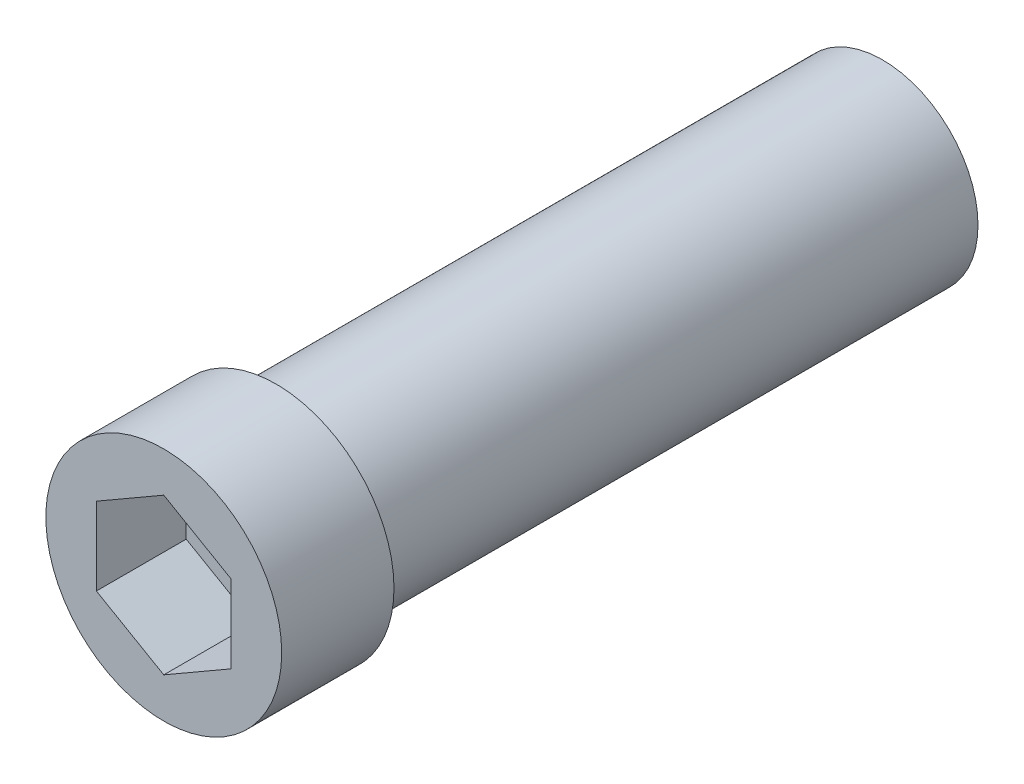
ISO-10303-21;
HEADER;
FILE_DESCRIPTION(('STEP AP214'),'2;1');
FILE_NAME('part.step','',(''),(''),'','','');
FILE_SCHEMA(('AUTOMOTIVE_DESIGN { 1 0 10303 214 1 1 1 1 }'));
ENDSEC;
DATA;
#1=APPLICATION_CONTEXT('core data for automotive mechanical design processes');
#2=APPLICATION_PROTOCOL_DEFINITION('international standard','automotive_design',2000,#1);
#3=PRODUCT_CONTEXT('',#1,'mechanical');
#4=PRODUCT('Part','Part','',(#3));
#5=PRODUCT_RELATED_PRODUCT_CATEGORY('part','',(#4));
#6=PRODUCT_DEFINITION_FORMATION('','',#4);
#7=PRODUCT_DEFINITION_CONTEXT('part definition',#1,'design');
#8=PRODUCT_DEFINITION('design','',#6,#7);
#9=PRODUCT_DEFINITION_SHAPE('','',#8);
#10=(LENGTH_UNIT() NAMED_UNIT(*) SI_UNIT(.MILLI.,.METRE.));
#11=(NAMED_UNIT(*) PLANE_ANGLE_UNIT() SI_UNIT($,.RADIAN.));
#12=(NAMED_UNIT(*) SI_UNIT($,.STERADIAN.) SOLID_ANGLE_UNIT());
#13=UNCERTAINTY_MEASURE_WITH_UNIT(LENGTH_MEASURE(1.E-05),#10,'distance_accuracy_value','');
#14=(GEOMETRIC_REPRESENTATION_CONTEXT(3) GLOBAL_UNCERTAINTY_ASSIGNED_CONTEXT((#13)) GLOBAL_UNIT_ASSIGNED_CONTEXT((#10,
#11,#12)) REPRESENTATION_CONTEXT('',''));
#15=CARTESIAN_POINT('',(0.,0.,0.));
#16=DIRECTION('',(0.,0.,1.));
#17=DIRECTION('',(1.,0.,0.));
#18=AXIS2_PLACEMENT_3D('',#15,#16,#17);
#19=CARTESIAN_POINT('',(0.,0.,0.));
#20=DIRECTION('',(0.,0.,1.));
#21=DIRECTION('',(1.,0.,0.));
#22=AXIS2_PLACEMENT_3D('',#19,#20,#21);
#23=CYLINDRICAL_SURFACE('',#22,1.75);
#24=CARTESIAN_POINT('',(0.,0.,0.));
#25=DIRECTION('',(0.,0.,1.));
#26=DIRECTION('',(1.,0.,0.));
#27=AXIS2_PLACEMENT_3D('',#24,#25,#26);
#28=CIRCLE('',#27,1.75);
#29=CARTESIAN_POINT('',(1.75,0.,0.));
#30=VERTEX_POINT('',#29);
#31=EDGE_CURVE('E147',#30,#30,#28,.T.);
#32=ORIENTED_EDGE('',*,*,#31,.F.);
#33=EDGE_LOOP('',(#32));
#34=FACE_BOUND('',#33,.T.);
#35=CARTESIAN_POINT('',(0.,0.,28.));
#36=DIRECTION('',(0.,0.,1.));
#37=DIRECTION('',(1.,0.,0.));
#38=AXIS2_PLACEMENT_3D('',#35,#36,#37);
#39=CIRCLE('',#38,1.75);
#40=CARTESIAN_POINT('',(1.75,0.,28.));
#41=VERTEX_POINT('',#40);
#42=EDGE_CURVE('E41',#41,#41,#39,.F.);
#43=ORIENTED_EDGE('',*,*,#42,.F.);
#44=EDGE_LOOP('',(#43));
#45=FACE_BOUND('',#44,.T.);
#46=ADVANCED_FACE('F37',(#34,#45),#23,.F.);
#47=CARTESIAN_POINT('',(0.,0.,27.));
#48=DIRECTION('',(0.,0.,-1.));
#49=DIRECTION('',(-1.,0.,0.));
#50=AXIS2_PLACEMENT_3D('',#47,#48,#49);
#51=CYLINDRICAL_SURFACE('',#50,4.25);
#52=CARTESIAN_POINT('',(0.,0.,27.));
#53=DIRECTION('',(0.,0.,1.));
#54=DIRECTION('',(1.,0.,0.));
#55=AXIS2_PLACEMENT_3D('',#52,#53,#54);
#56=CIRCLE('',#55,4.25);
#57=CARTESIAN_POINT('',(4.25,0.,27.));
#58=VERTEX_POINT('',#57);
#59=EDGE_CURVE('E11',#58,#58,#56,.T.);
#60=ORIENTED_EDGE('',*,*,#59,.F.);
#61=EDGE_LOOP('',(#60));
#62=FACE_BOUND('',#61,.T.);
#63=CARTESIAN_POINT('',(0.,0.,0.));
#64=DIRECTION('',(0.,0.,1.));
#65=DIRECTION('',(1.,0.,0.));
#66=AXIS2_PLACEMENT_3D('',#63,#64,#65);
#67=CIRCLE('',#66,4.25);
#68=CARTESIAN_POINT('',(4.25,0.,0.));
#69=VERTEX_POINT('',#68);
#70=EDGE_CURVE('E46',#69,#69,#67,.T.);
#71=ORIENTED_EDGE('',*,*,#70,.T.);
#72=EDGE_LOOP('',(#71));
#73=FACE_BOUND('',#72,.T.);
#74=ADVANCED_FACE('F39',(#62,#73),#51,.T.);
#75=CARTESIAN_POINT('',(0.,0.,0.));
#76=DIRECTION('',(0.,0.,1.));
#77=DIRECTION('',(1.,0.,0.));
#78=AXIS2_PLACEMENT_3D('',#75,#76,#77);
#79=PLANE('',#78);
#80=ORIENTED_EDGE('',*,*,#31,.T.);
#81=EDGE_LOOP('',(#80));
#82=FACE_BOUND('',#81,.T.);
#83=ORIENTED_EDGE('',*,*,#70,.F.);
#84=EDGE_LOOP('',(#83));
#85=FACE_BOUND('',#84,.T.);
#86=ADVANCED_FACE('F159',(#82,#85),#79,.F.);
#87=CARTESIAN_POINT('',(0.,0.,32.));
#88=DIRECTION('',(0.,0.,-1.));
#89=DIRECTION('',(-1.,0.,0.));
#90=AXIS2_PLACEMENT_3D('',#87,#88,#89);
#91=CYLINDRICAL_SURFACE('',#90,5.25);
#92=CARTESIAN_POINT('',(0.,0.,32.));
#93=DIRECTION('',(0.,0.,1.));
#94=DIRECTION('',(1.,0.,0.));
#95=AXIS2_PLACEMENT_3D('',#92,#93,#94);
#96=CIRCLE('',#95,5.25);
#97=CARTESIAN_POINT('',(5.25,0.,32.));
#98=VERTEX_POINT('',#97);
#99=EDGE_CURVE('E151',#98,#98,#96,.T.);
#100=ORIENTED_EDGE('',*,*,#99,.F.);
#101=EDGE_LOOP('',(#100));
#102=FACE_BOUND('',#101,.T.);
#103=CARTESIAN_POINT('',(0.,0.,27.));
#104=DIRECTION('',(0.,0.,1.));
#105=DIRECTION('',(1.,0.,0.));
#106=AXIS2_PLACEMENT_3D('',#103,#104,#105);
#107=CIRCLE('',#106,5.25);
#108=CARTESIAN_POINT('',(5.25,0.,27.));
#109=VERTEX_POINT('',#108);
#110=EDGE_CURVE('E150',#109,#109,#107,.T.);
#111=ORIENTED_EDGE('',*,*,#110,.T.);
#112=EDGE_LOOP('',(#111));
#113=FACE_BOUND('',#112,.T.);
#114=ADVANCED_FACE('F161',(#102,#113),#91,.T.);
#115=CARTESIAN_POINT('',(0.,0.,32.));
#116=DIRECTION('',(0.,0.,1.));
#117=DIRECTION('',(1.,0.,0.));
#118=AXIS2_PLACEMENT_3D('',#115,#116,#117);
#119=PLANE('',#118);
#120=DIRECTION('',(-0.866025403784439,0.5,0.));
#121=VECTOR('',#120,1.);
#122=CARTESIAN_POINT('',(3.,1.73205080756888,32.));
#123=LINE('',#122,#121);
#124=CARTESIAN_POINT('',(3.,1.73205080756888,32.));
#125=VERTEX_POINT('',#124);
#126=CARTESIAN_POINT('',(0.,3.46410161513776,32.));
#127=VERTEX_POINT('',#126);
#128=EDGE_CURVE('E54',#125,#127,#123,.T.);
#129=ORIENTED_EDGE('',*,*,#128,.F.);
#130=DIRECTION('',(0.,1.,0.));
#131=VECTOR('',#130,1.);
#132=CARTESIAN_POINT('',(3.,-1.73205080756888,32.));
#133=LINE('',#132,#131);
#134=CARTESIAN_POINT('',(3.,-1.73205080756888,32.));
#135=VERTEX_POINT('',#134);
#136=EDGE_CURVE('E138',#135,#125,#133,.T.);
#137=ORIENTED_EDGE('',*,*,#136,.F.);
#138=DIRECTION('',(0.866025403784439,0.5,0.));
#139=VECTOR('',#138,1.);
#140=CARTESIAN_POINT('',(0.,-3.46410161513775,32.));
#141=LINE('',#140,#139);
#142=CARTESIAN_POINT('',(0.,-3.46410161513775,32.));
#143=VERTEX_POINT('',#142);
#144=EDGE_CURVE('E136',#143,#135,#141,.T.);
#145=ORIENTED_EDGE('',*,*,#144,.F.);
#146=DIRECTION('',(0.866025403784439,-0.5,0.));
#147=VECTOR('',#146,1.);
#148=CARTESIAN_POINT('',(-3.,-1.73205080756888,32.));
#149=LINE('',#148,#147);
#150=CARTESIAN_POINT('',(-3.,-1.73205080756888,32.));
#151=VERTEX_POINT('',#150);
#152=EDGE_CURVE('E102',#151,#143,#149,.T.);
#153=ORIENTED_EDGE('',*,*,#152,.F.);
#154=DIRECTION('',(0.,-1.,0.));
#155=VECTOR('',#154,1.);
#156=CARTESIAN_POINT('',(-3.,1.73205080756888,32.));
#157=LINE('',#156,#155);
#158=CARTESIAN_POINT('',(-3.,1.73205080756888,32.));
#159=VERTEX_POINT('',#158);
#160=EDGE_CURVE('E132',#159,#151,#157,.T.);
#161=ORIENTED_EDGE('',*,*,#160,.F.);
#162=DIRECTION('',(-0.866025403784439,-0.5,0.));
#163=VECTOR('',#162,1.);
#164=CARTESIAN_POINT('',(0.,3.46410161513776,32.));
#165=LINE('',#164,#163);
#166=EDGE_CURVE('E129',#127,#159,#165,.T.);
#167=ORIENTED_EDGE('',*,*,#166,.F.);
#168=EDGE_LOOP('',(#129,#137,#145,#153,#161,#167));
#169=FACE_BOUND('',#168,.T.);
#170=ORIENTED_EDGE('',*,*,#99,.T.);
#171=EDGE_LOOP('',(#170));
#172=FACE_BOUND('',#171,.T.);
#173=ADVANCED_FACE('F167',(#169,#172),#119,.T.);
#174=CARTESIAN_POINT('',(0.,0.,27.));
#175=DIRECTION('',(0.,0.,1.));
#176=DIRECTION('',(1.,0.,0.));
#177=AXIS2_PLACEMENT_3D('',#174,#175,#176);
#178=PLANE('',#177);
#179=ORIENTED_EDGE('',*,*,#59,.T.);
#180=EDGE_LOOP('',(#179));
#181=FACE_BOUND('',#180,.T.);
#182=ORIENTED_EDGE('',*,*,#110,.F.);
#183=EDGE_LOOP('',(#182));
#184=FACE_BOUND('',#183,.T.);
#185=ADVANCED_FACE('F184',(#181,#184),#178,.F.);
#186=CARTESIAN_POINT('',(0.,0.,28.));
#187=DIRECTION('',(0.,0.,1.));
#188=DIRECTION('',(1.,0.,0.));
#189=AXIS2_PLACEMENT_3D('',#186,#187,#188);
#190=PLANE('',#189);
#191=DIRECTION('',(-0.866025403784439,0.5,0.));
#192=VECTOR('',#191,1.);
#193=CARTESIAN_POINT('',(3.,1.73205080756888,28.));
#194=LINE('',#193,#192);
#195=CARTESIAN_POINT('',(3.,1.73205080756888,28.));
#196=VERTEX_POINT('',#195);
#197=CARTESIAN_POINT('',(0.,3.46410161513776,28.));
#198=VERTEX_POINT('',#197);
#199=EDGE_CURVE('E140',#196,#198,#194,.T.);
#200=ORIENTED_EDGE('',*,*,#199,.T.);
#201=DIRECTION('',(-0.866025403784439,-0.5,0.));
#202=VECTOR('',#201,1.);
#203=CARTESIAN_POINT('',(0.,3.46410161513776,28.));
#204=LINE('',#203,#202);
#205=CARTESIAN_POINT('',(-3.,1.73205080756888,28.));
#206=VERTEX_POINT('',#205);
#207=EDGE_CURVE('E123',#198,#206,#204,.T.);
#208=ORIENTED_EDGE('',*,*,#207,.T.);
#209=DIRECTION('',(0.,-1.,0.));
#210=VECTOR('',#209,1.);
#211=CARTESIAN_POINT('',(-3.,1.73205080756888,28.));
#212=LINE('',#211,#210);
#213=CARTESIAN_POINT('',(-3.,-1.73205080756888,28.));
#214=VERTEX_POINT('',#213);
#215=EDGE_CURVE('E121',#206,#214,#212,.T.);
#216=ORIENTED_EDGE('',*,*,#215,.T.);
#217=DIRECTION('',(0.866025403784439,-0.5,0.));
#218=VECTOR('',#217,1.);
#219=CARTESIAN_POINT('',(-3.,-1.73205080756888,28.));
#220=LINE('',#219,#218);
#221=CARTESIAN_POINT('',(0.,-3.46410161513775,28.));
#222=VERTEX_POINT('',#221);
#223=EDGE_CURVE('E99',#214,#222,#220,.T.);
#224=ORIENTED_EDGE('',*,*,#223,.T.);
#225=DIRECTION('',(0.866025403784439,0.5,0.));
#226=VECTOR('',#225,1.);
#227=CARTESIAN_POINT('',(0.,-3.46410161513775,28.));
#228=LINE('',#227,#226);
#229=CARTESIAN_POINT('',(3.,-1.73205080756888,28.));
#230=VERTEX_POINT('',#229);
#231=EDGE_CURVE('E110',#222,#230,#228,.T.);
#232=ORIENTED_EDGE('',*,*,#231,.T.);
#233=DIRECTION('',(0.,1.,0.));
#234=VECTOR('',#233,1.);
#235=CARTESIAN_POINT('',(3.,-1.73205080756888,28.));
#236=LINE('',#235,#234);
#237=EDGE_CURVE('E114',#230,#196,#236,.T.);
#238=ORIENTED_EDGE('',*,*,#237,.T.);
#239=EDGE_LOOP('',(#200,#208,#216,#224,#232,#238));
#240=FACE_BOUND('',#239,.T.);
#241=ORIENTED_EDGE('',*,*,#42,.T.);
#242=EDGE_LOOP('',(#241));
#243=FACE_BOUND('',#242,.T.);
#244=ADVANCED_FACE('F117',(#240,#243),#190,.T.);
#245=CARTESIAN_POINT('',(3.,1.73205080756888,28.));
#246=DIRECTION('',(0.5,0.866025403784439,0.));
#247=DIRECTION('',(-0.866025403784439,0.5,0.));
#248=AXIS2_PLACEMENT_3D('',#245,#246,#247);
#249=PLANE('',#248);
#250=ORIENTED_EDGE('',*,*,#128,.T.);
#251=DIRECTION('',(0.,0.,1.));
#252=VECTOR('',#251,1.);
#253=CARTESIAN_POINT('',(0.,3.46410161513776,28.));
#254=LINE('',#253,#252);
#255=EDGE_CURVE('E84',#198,#127,#254,.T.);
#256=ORIENTED_EDGE('',*,*,#255,.F.);
#257=ORIENTED_EDGE('',*,*,#199,.F.);
#258=DIRECTION('',(0.,0.,1.));
#259=VECTOR('',#258,1.);
#260=CARTESIAN_POINT('',(3.,1.73205080756888,28.));
#261=LINE('',#260,#259);
#262=EDGE_CURVE('E62',#196,#125,#261,.T.);
#263=ORIENTED_EDGE('',*,*,#262,.T.);
#264=EDGE_LOOP('',(#250,#256,#257,#263));
#265=FACE_BOUND('',#264,.T.);
#266=ADVANCED_FACE('F180',(#265),#249,.F.);
#267=CARTESIAN_POINT('',(3.,-1.73205080756888,28.));
#268=DIRECTION('',(1.,0.,0.));
#269=DIRECTION('',(0.,0.,-1.));
#270=AXIS2_PLACEMENT_3D('',#267,#268,#269);
#271=PLANE('',#270);
#272=ORIENTED_EDGE('',*,*,#136,.T.);
#273=ORIENTED_EDGE('',*,*,#262,.F.);
#274=ORIENTED_EDGE('',*,*,#237,.F.);
#275=DIRECTION('',(0.,0.,1.));
#276=VECTOR('',#275,1.);
#277=CARTESIAN_POINT('',(3.,-1.73205080756888,28.));
#278=LINE('',#277,#276);
#279=EDGE_CURVE('E106',#230,#135,#278,.T.);
#280=ORIENTED_EDGE('',*,*,#279,.T.);
#281=EDGE_LOOP('',(#272,#273,#274,#280));
#282=FACE_BOUND('',#281,.T.);
#283=ADVANCED_FACE('F199',(#282),#271,.F.);
#284=CARTESIAN_POINT('',(0.,-3.46410161513775,28.));
#285=DIRECTION('',(0.5,-0.866025403784439,0.));
#286=DIRECTION('',(0.866025403784439,0.5,0.));
#287=AXIS2_PLACEMENT_3D('',#284,#285,#286);
#288=PLANE('',#287);
#289=ORIENTED_EDGE('',*,*,#144,.T.);
#290=ORIENTED_EDGE('',*,*,#279,.F.);
#291=ORIENTED_EDGE('',*,*,#231,.F.);
#292=DIRECTION('',(0.,0.,1.));
#293=VECTOR('',#292,1.);
#294=CARTESIAN_POINT('',(0.,-3.46410161513775,28.));
#295=LINE('',#294,#293);
#296=EDGE_CURVE('E95',#222,#143,#295,.T.);
#297=ORIENTED_EDGE('',*,*,#296,.T.);
#298=EDGE_LOOP('',(#289,#290,#291,#297));
#299=FACE_BOUND('',#298,.T.);
#300=ADVANCED_FACE('F111',(#299),#288,.F.);
#301=CARTESIAN_POINT('',(-3.,-1.73205080756888,28.));
#302=DIRECTION('',(-0.5,-0.866025403784439,0.));
#303=DIRECTION('',(0.866025403784439,-0.5,0.));
#304=AXIS2_PLACEMENT_3D('',#301,#302,#303);
#305=PLANE('',#304);
#306=ORIENTED_EDGE('',*,*,#152,.T.);
#307=ORIENTED_EDGE('',*,*,#296,.F.);
#308=ORIENTED_EDGE('',*,*,#223,.F.);
#309=DIRECTION('',(0.,0.,1.));
#310=VECTOR('',#309,1.);
#311=CARTESIAN_POINT('',(-3.,-1.73205080756888,28.));
#312=LINE('',#311,#310);
#313=EDGE_CURVE('E107',#214,#151,#312,.T.);
#314=ORIENTED_EDGE('',*,*,#313,.T.);
#315=EDGE_LOOP('',(#306,#307,#308,#314));
#316=FACE_BOUND('',#315,.T.);
#317=ADVANCED_FACE('F97',(#316),#305,.F.);
#318=CARTESIAN_POINT('',(-3.,1.73205080756888,28.));
#319=DIRECTION('',(-1.,0.,0.));
#320=DIRECTION('',(0.,0.,1.));
#321=AXIS2_PLACEMENT_3D('',#318,#319,#320);
#322=PLANE('',#321);
#323=ORIENTED_EDGE('',*,*,#160,.T.);
#324=ORIENTED_EDGE('',*,*,#313,.F.);
#325=ORIENTED_EDGE('',*,*,#215,.F.);
#326=DIRECTION('',(0.,0.,1.));
#327=VECTOR('',#326,1.);
#328=CARTESIAN_POINT('',(-3.,1.73205080756888,28.));
#329=LINE('',#328,#327);
#330=EDGE_CURVE('E144',#206,#159,#329,.T.);
#331=ORIENTED_EDGE('',*,*,#330,.T.);
#332=EDGE_LOOP('',(#323,#324,#325,#331));
#333=FACE_BOUND('',#332,.T.);
#334=ADVANCED_FACE('F207',(#333),#322,.F.);
#335=CARTESIAN_POINT('',(0.,3.46410161513776,28.));
#336=DIRECTION('',(-0.5,0.866025403784439,0.));
#337=DIRECTION('',(-0.866025403784439,-0.5,0.));
#338=AXIS2_PLACEMENT_3D('',#335,#336,#337);
#339=PLANE('',#338);
#340=ORIENTED_EDGE('',*,*,#166,.T.);
#341=ORIENTED_EDGE('',*,*,#330,.F.);
#342=ORIENTED_EDGE('',*,*,#207,.F.);
#343=ORIENTED_EDGE('',*,*,#255,.T.);
#344=EDGE_LOOP('',(#340,#341,#342,#343));
#345=FACE_BOUND('',#344,.T.);
#346=ADVANCED_FACE('F209',(#345),#339,.F.);
#347=CLOSED_SHELL('',(#46,#74,#86,#114,#173,#185,#244,#266,#283,#300,#317,#334,#346));
#348=MANIFOLD_SOLID_BREP('B2',#347);
#349=ADVANCED_BREP_SHAPE_REPRESENTATION('',(#18,#348),#14);
#350=SHAPE_DEFINITION_REPRESENTATION(#9,#349);
ENDSEC;
END-ISO-10303-21;
